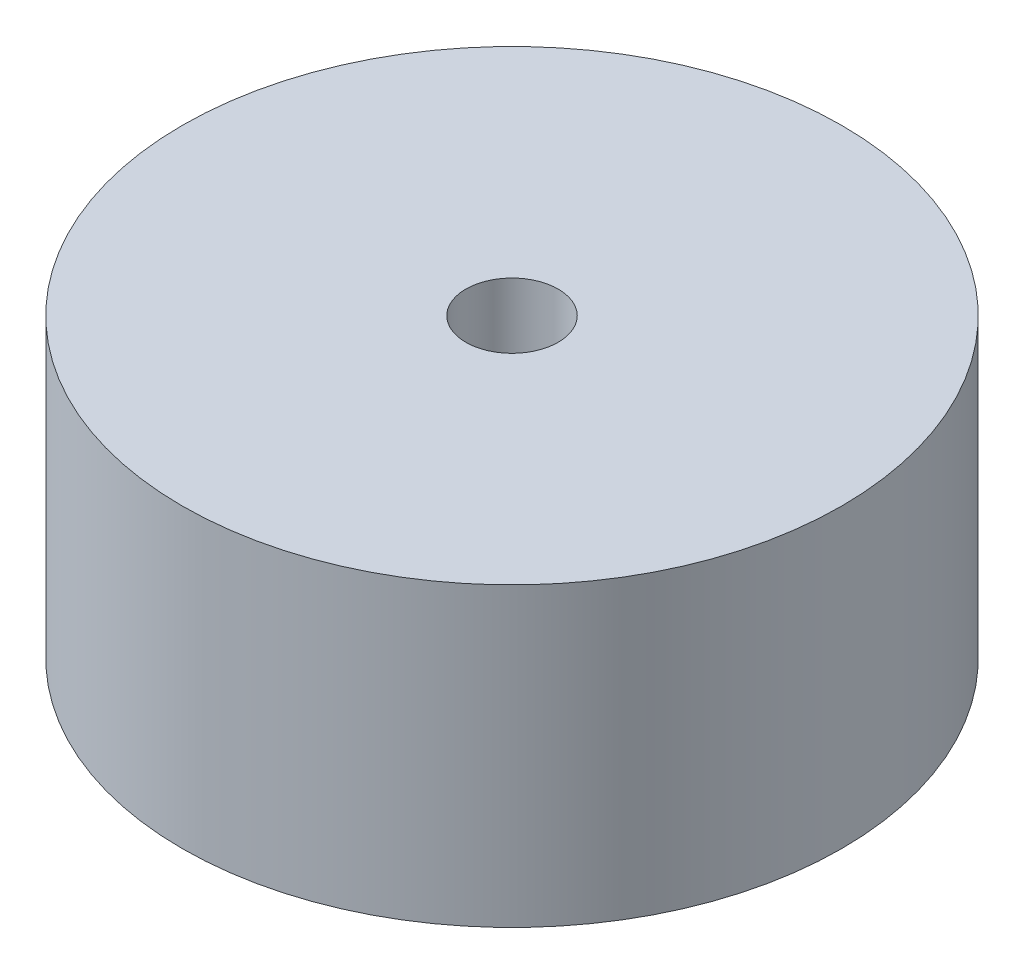
ISO-10303-21;
HEADER;
FILE_DESCRIPTION(('STEP AP214'),'2;1');
FILE_NAME('part.step','',(''),(''),'','','');
FILE_SCHEMA(('AUTOMOTIVE_DESIGN { 1 0 10303 214 1 1 1 1 }'));
ENDSEC;
DATA;
#1=APPLICATION_CONTEXT('core data for automotive mechanical design processes');
#2=APPLICATION_PROTOCOL_DEFINITION('international standard','automotive_design',2000,#1);
#3=PRODUCT_CONTEXT('',#1,'mechanical');
#4=PRODUCT('Part','Part','',(#3));
#5=PRODUCT_RELATED_PRODUCT_CATEGORY('part','',(#4));
#6=PRODUCT_DEFINITION_FORMATION('','',#4);
#7=PRODUCT_DEFINITION_CONTEXT('part definition',#1,'design');
#8=PRODUCT_DEFINITION('design','',#6,#7);
#9=PRODUCT_DEFINITION_SHAPE('','',#8);
#10=(LENGTH_UNIT() NAMED_UNIT(*) SI_UNIT(.MILLI.,.METRE.));
#11=(NAMED_UNIT(*) PLANE_ANGLE_UNIT() SI_UNIT($,.RADIAN.));
#12=(NAMED_UNIT(*) SI_UNIT($,.STERADIAN.) SOLID_ANGLE_UNIT());
#13=UNCERTAINTY_MEASURE_WITH_UNIT(LENGTH_MEASURE(1.E-05),#10,'distance_accuracy_value','');
#14=(GEOMETRIC_REPRESENTATION_CONTEXT(3) GLOBAL_UNCERTAINTY_ASSIGNED_CONTEXT((#13)) GLOBAL_UNIT_ASSIGNED_CONTEXT((#10,
#11,#12)) REPRESENTATION_CONTEXT('',''));
#15=CARTESIAN_POINT('',(0.,0.,0.));
#16=DIRECTION('',(0.,0.,1.));
#17=DIRECTION('',(1.,0.,0.));
#18=AXIS2_PLACEMENT_3D('',#15,#16,#17);
#19=CARTESIAN_POINT('',(-50.6,0.,-50.6));
#20=DIRECTION('',(0.,1.,0.));
#21=DIRECTION('',(0.,0.,1.));
#22=AXIS2_PLACEMENT_3D('',#19,#20,#21);
#23=PLANE('',#22);
#24=CARTESIAN_POINT('',(0.,0.,0.));
#25=DIRECTION('',(0.,-1.,0.));
#26=DIRECTION('',(0.,0.,-1.));
#27=AXIS2_PLACEMENT_3D('',#24,#25,#26);
#28=CIRCLE('',#27,50.);
#29=CARTESIAN_POINT('',(0.,0.,-50.));
#30=VERTEX_POINT('',#29);
#31=EDGE_CURVE('E19',#30,#30,#28,.T.);
#32=ORIENTED_EDGE('',*,*,#31,.T.);
#33=EDGE_LOOP('',(#32));
#34=FACE_BOUND('',#33,.T.);
#35=ADVANCED_FACE('F15',(#34),#23,.F.);
#36=CARTESIAN_POINT('',(0.,45.,0.));
#37=DIRECTION('',(0.,-1.,0.));
#38=DIRECTION('',(0.,0.,-1.));
#39=AXIS2_PLACEMENT_3D('',#36,#37,#38);
#40=CYLINDRICAL_SURFACE('',#39,50.);
#41=ORIENTED_EDGE('',*,*,#31,.F.);
#42=EDGE_LOOP('',(#41));
#43=FACE_BOUND('',#42,.T.);
#44=CARTESIAN_POINT('',(0.,45.,0.));
#45=DIRECTION('',(0.,-1.,0.));
#46=DIRECTION('',(0.,0.,-1.));
#47=AXIS2_PLACEMENT_3D('',#44,#45,#46);
#48=CIRCLE('',#47,50.);
#49=CARTESIAN_POINT('',(0.,45.,-50.));
#50=VERTEX_POINT('',#49);
#51=EDGE_CURVE('E28',#50,#50,#48,.F.);
#52=ORIENTED_EDGE('',*,*,#51,.F.);
#53=EDGE_LOOP('',(#52));
#54=FACE_BOUND('',#53,.T.);
#55=ADVANCED_FACE('F37',(#43,#54),#40,.T.);
#56=CARTESIAN_POINT('',(-7.084,30.,-7.084));
#57=DIRECTION('',(0.,1.,0.));
#58=DIRECTION('',(0.,0.,1.));
#59=AXIS2_PLACEMENT_3D('',#56,#57,#58);
#60=PLANE('',#59);
#61=CARTESIAN_POINT('',(0.,30.,0.));
#62=DIRECTION('',(0.,1.,0.));
#63=DIRECTION('',(-1.,0.,0.));
#64=AXIS2_PLACEMENT_3D('',#61,#62,#63);
#65=CIRCLE('',#64,7.);
#66=CARTESIAN_POINT('',(-7.,30.,0.));
#67=VERTEX_POINT('',#66);
#68=EDGE_CURVE('E23',#67,#67,#65,.F.);
#69=ORIENTED_EDGE('',*,*,#68,.F.);
#70=EDGE_LOOP('',(#69));
#71=FACE_BOUND('',#70,.T.);
#72=ADVANCED_FACE('F40',(#71),#60,.T.);
#73=CARTESIAN_POINT('',(-50.6,45.,-50.6));
#74=DIRECTION('',(0.,1.,0.));
#75=DIRECTION('',(0.,0.,1.));
#76=AXIS2_PLACEMENT_3D('',#73,#74,#75);
#77=PLANE('',#76);
#78=CARTESIAN_POINT('',(0.,45.,0.));
#79=DIRECTION('',(0.,1.,0.));
#80=DIRECTION('',(-1.,0.,0.));
#81=AXIS2_PLACEMENT_3D('',#78,#79,#80);
#82=CIRCLE('',#81,7.);
#83=CARTESIAN_POINT('',(-7.,45.,0.));
#84=VERTEX_POINT('',#83);
#85=EDGE_CURVE('E10',#84,#84,#82,.T.);
#86=ORIENTED_EDGE('',*,*,#85,.F.);
#87=EDGE_LOOP('',(#86));
#88=FACE_BOUND('',#87,.T.);
#89=ORIENTED_EDGE('',*,*,#51,.T.);
#90=EDGE_LOOP('',(#89));
#91=FACE_BOUND('',#90,.T.);
#92=ADVANCED_FACE('F17',(#88,#91),#77,.T.);
#93=CARTESIAN_POINT('',(0.,30.,0.));
#94=DIRECTION('',(0.,1.,0.));
#95=DIRECTION('',(-1.,0.,0.));
#96=AXIS2_PLACEMENT_3D('',#93,#94,#95);
#97=CYLINDRICAL_SURFACE('',#96,7.);
#98=ORIENTED_EDGE('',*,*,#85,.T.);
#99=EDGE_LOOP('',(#98));
#100=FACE_BOUND('',#99,.T.);
#101=ORIENTED_EDGE('',*,*,#68,.T.);
#102=EDGE_LOOP('',(#101));
#103=FACE_BOUND('',#102,.T.);
#104=ADVANCED_FACE('F50',(#100,#103),#97,.F.);
#105=CLOSED_SHELL('',(#35,#55,#72,#92,#104));
#106=MANIFOLD_SOLID_BREP('B1',#105);
#107=ADVANCED_BREP_SHAPE_REPRESENTATION('',(#18,#106),#14);
#108=SHAPE_DEFINITION_REPRESENTATION(#9,#107);
ENDSEC;
END-ISO-10303-21;
